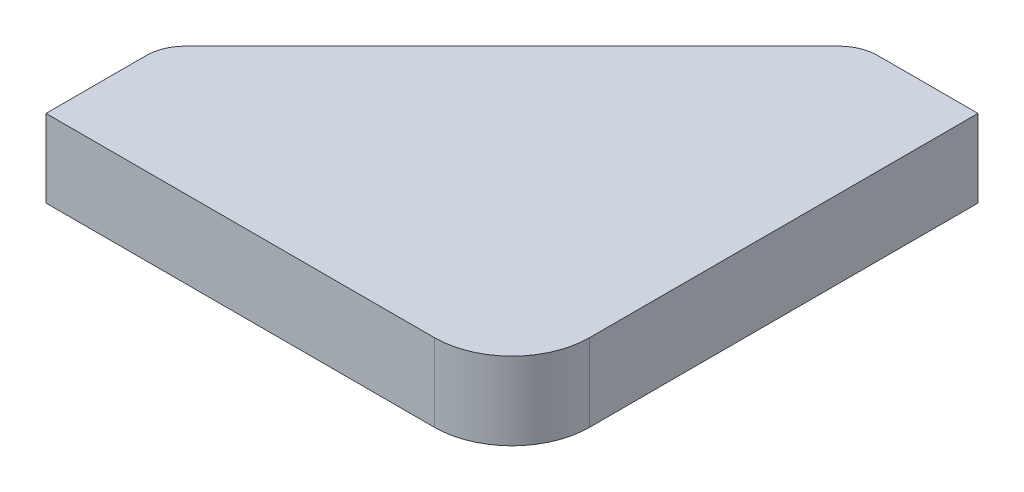
ISO-10303-21;
HEADER;
FILE_DESCRIPTION(('STEP AP214'),'2;1');
FILE_NAME('part.step','',(''),(''),'','','');
FILE_SCHEMA(('AUTOMOTIVE_DESIGN { 1 0 10303 214 1 1 1 1 }'));
ENDSEC;
DATA;
#1=APPLICATION_CONTEXT('core data for automotive mechanical design processes');
#2=APPLICATION_PROTOCOL_DEFINITION('international standard','automotive_design',2000,#1);
#3=PRODUCT_CONTEXT('',#1,'mechanical');
#4=PRODUCT('Part','Part','',(#3));
#5=PRODUCT_RELATED_PRODUCT_CATEGORY('part','',(#4));
#6=PRODUCT_DEFINITION_FORMATION('','',#4);
#7=PRODUCT_DEFINITION_CONTEXT('part definition',#1,'design');
#8=PRODUCT_DEFINITION('design','',#6,#7);
#9=PRODUCT_DEFINITION_SHAPE('','',#8);
#10=(LENGTH_UNIT() NAMED_UNIT(*) SI_UNIT(.MILLI.,.METRE.));
#11=(NAMED_UNIT(*) PLANE_ANGLE_UNIT() SI_UNIT($,.RADIAN.));
#12=(NAMED_UNIT(*) SI_UNIT($,.STERADIAN.) SOLID_ANGLE_UNIT());
#13=UNCERTAINTY_MEASURE_WITH_UNIT(LENGTH_MEASURE(1.E-05),#10,'distance_accuracy_value','');
#14=(GEOMETRIC_REPRESENTATION_CONTEXT(3) GLOBAL_UNCERTAINTY_ASSIGNED_CONTEXT((#13)) GLOBAL_UNIT_ASSIGNED_CONTEXT((#10,
#11,#12)) REPRESENTATION_CONTEXT('',''));
#15=CARTESIAN_POINT('',(0.,0.,0.));
#16=DIRECTION('',(0.,0.,1.));
#17=DIRECTION('',(1.,0.,0.));
#18=AXIS2_PLACEMENT_3D('',#15,#16,#17);
#19=CARTESIAN_POINT('',(-60.,-70.,-15.));
#20=DIRECTION('',(1.,0.,0.));
#21=DIRECTION('',(0.,0.,-1.));
#22=AXIS2_PLACEMENT_3D('',#19,#20,#21);
#23=PLANE('',#22);
#24=DIRECTION('',(0.,0.,-1.));
#25=VECTOR('',#24,1.);
#26=CARTESIAN_POINT('',(-60.,-60.,-15.));
#27=LINE('',#26,#25);
#28=CARTESIAN_POINT('',(-60.,-60.,0.));
#29=VERTEX_POINT('',#28);
#30=CARTESIAN_POINT('',(-60.,-60.,-12.9289321881345));
#31=VERTEX_POINT('',#30);
#32=EDGE_CURVE('E131',#29,#31,#27,.T.);
#33=ORIENTED_EDGE('',*,*,#32,.T.);
#34=DIRECTION('',(0.,1.,0.));
#35=VECTOR('',#34,1.);
#36=CARTESIAN_POINT('',(-60.,-70.,-12.9289321881345));
#37=LINE('',#36,#35);
#38=CARTESIAN_POINT('',(-60.,-70.,-12.9289321881345));
#39=VERTEX_POINT('',#38);
#40=EDGE_CURVE('E59',#31,#39,#37,.F.);
#41=ORIENTED_EDGE('',*,*,#40,.T.);
#42=DIRECTION('',(0.,0.,-1.));
#43=VECTOR('',#42,1.);
#44=CARTESIAN_POINT('',(-60.,-70.,-15.));
#45=LINE('',#44,#43);
#46=CARTESIAN_POINT('',(-60.,-70.,0.));
#47=VERTEX_POINT('',#46);
#48=EDGE_CURVE('E141',#47,#39,#45,.T.);
#49=ORIENTED_EDGE('',*,*,#48,.F.);
#50=DIRECTION('',(0.,1.,0.));
#51=VECTOR('',#50,1.);
#52=CARTESIAN_POINT('',(-60.,-70.,0.));
#53=LINE('',#52,#51);
#54=EDGE_CURVE('E121',#47,#29,#53,.T.);
#55=ORIENTED_EDGE('',*,*,#54,.T.);
#56=EDGE_LOOP('',(#33,#41,#49,#55));
#57=FACE_BOUND('',#56,.T.);
#58=ADVANCED_FACE('F36',(#57),#23,.F.);
#59=CARTESIAN_POINT('',(-15.,-70.,-60.));
#60=DIRECTION('',(0.707106781186547,0.,0.707106781186548));
#61=DIRECTION('',(0.707106781186548,0.,-0.707106781186547));
#62=AXIS2_PLACEMENT_3D('',#59,#60,#61);
#63=PLANE('',#62);
#64=DIRECTION('',(0.707106781186548,0.,-0.707106781186547));
#65=VECTOR('',#64,1.);
#66=CARTESIAN_POINT('',(-15.,-70.,-60.));
#67=LINE('',#66,#65);
#68=CARTESIAN_POINT('',(-58.5355339059328,-70.,-16.4644660940673));
#69=VERTEX_POINT('',#68);
#70=CARTESIAN_POINT('',(-16.4644660940673,-70.,-58.5355339059327));
#71=VERTEX_POINT('',#70);
#72=EDGE_CURVE('E110',#69,#71,#67,.T.);
#73=ORIENTED_EDGE('',*,*,#72,.F.);
#74=DIRECTION('',(0.,1.,0.));
#75=VECTOR('',#74,1.);
#76=CARTESIAN_POINT('',(-58.5355339059328,-70.,-16.4644660940673));
#77=LINE('',#76,#75);
#78=CARTESIAN_POINT('',(-58.5355339059328,-60.,-16.4644660940673));
#79=VERTEX_POINT('',#78);
#80=EDGE_CURVE('E153',#69,#79,#77,.T.);
#81=ORIENTED_EDGE('',*,*,#80,.T.);
#82=DIRECTION('',(0.707106781186548,0.,-0.707106781186547));
#83=VECTOR('',#82,1.);
#84=CARTESIAN_POINT('',(-15.,-60.,-60.));
#85=LINE('',#84,#83);
#86=CARTESIAN_POINT('',(-16.4644660940673,-60.,-58.5355339059327));
#87=VERTEX_POINT('',#86);
#88=EDGE_CURVE('E133',#79,#87,#85,.T.);
#89=ORIENTED_EDGE('',*,*,#88,.T.);
#90=DIRECTION('',(0.,1.,0.));
#91=VECTOR('',#90,1.);
#92=CARTESIAN_POINT('',(-16.4644660940673,-70.,-58.5355339059327));
#93=LINE('',#92,#91);
#94=EDGE_CURVE('E151',#87,#71,#93,.F.);
#95=ORIENTED_EDGE('',*,*,#94,.T.);
#96=EDGE_LOOP('',(#73,#81,#89,#95));
#97=FACE_BOUND('',#96,.T.);
#98=ADVANCED_FACE('F166',(#97),#63,.F.);
#99=CARTESIAN_POINT('',(0.,-70.,-60.));
#100=DIRECTION('',(0.,0.,1.));
#101=DIRECTION('',(1.,0.,0.));
#102=AXIS2_PLACEMENT_3D('',#99,#100,#101);
#103=PLANE('',#102);
#104=DIRECTION('',(1.,0.,0.));
#105=VECTOR('',#104,1.);
#106=CARTESIAN_POINT('',(0.,-70.,-60.));
#107=LINE('',#106,#105);
#108=CARTESIAN_POINT('',(-12.9289321881345,-70.,-60.));
#109=VERTEX_POINT('',#108);
#110=CARTESIAN_POINT('',(0.,-70.,-60.));
#111=VERTEX_POINT('',#110);
#112=EDGE_CURVE('E102',#109,#111,#107,.T.);
#113=ORIENTED_EDGE('',*,*,#112,.F.);
#114=DIRECTION('',(0.,1.,0.));
#115=VECTOR('',#114,1.);
#116=CARTESIAN_POINT('',(-12.9289321881345,-70.,-60.));
#117=LINE('',#116,#115);
#118=CARTESIAN_POINT('',(-12.9289321881345,-60.,-60.));
#119=VERTEX_POINT('',#118);
#120=EDGE_CURVE('E11',#109,#119,#117,.T.);
#121=ORIENTED_EDGE('',*,*,#120,.T.);
#122=DIRECTION('',(1.,0.,0.));
#123=VECTOR('',#122,1.);
#124=CARTESIAN_POINT('',(0.,-60.,-60.));
#125=LINE('',#124,#123);
#126=CARTESIAN_POINT('',(0.,-60.,-60.));
#127=VERTEX_POINT('',#126);
#128=EDGE_CURVE('E116',#119,#127,#125,.T.);
#129=ORIENTED_EDGE('',*,*,#128,.T.);
#130=DIRECTION('',(0.,1.,0.));
#131=VECTOR('',#130,1.);
#132=CARTESIAN_POINT('',(0.,-70.,-60.));
#133=LINE('',#132,#131);
#134=EDGE_CURVE('E113',#111,#127,#133,.T.);
#135=ORIENTED_EDGE('',*,*,#134,.F.);
#136=EDGE_LOOP('',(#113,#121,#129,#135));
#137=FACE_BOUND('',#136,.T.);
#138=ADVANCED_FACE('F114',(#137),#103,.F.);
#139=CARTESIAN_POINT('',(0.,-70.,0.));
#140=DIRECTION('',(-1.,0.,0.));
#141=DIRECTION('',(0.,0.,1.));
#142=AXIS2_PLACEMENT_3D('',#139,#140,#141);
#143=PLANE('',#142);
#144=DIRECTION('',(0.,0.,1.));
#145=VECTOR('',#144,1.);
#146=CARTESIAN_POINT('',(0.,-60.,0.));
#147=LINE('',#146,#145);
#148=CARTESIAN_POINT('',(0.,-60.,-10.));
#149=VERTEX_POINT('',#148);
#150=EDGE_CURVE('E137',#127,#149,#147,.T.);
#151=ORIENTED_EDGE('',*,*,#150,.T.);
#152=DIRECTION('',(0.,1.,0.));
#153=VECTOR('',#152,1.);
#154=CARTESIAN_POINT('',(0.,-70.,-10.));
#155=LINE('',#154,#153);
#156=CARTESIAN_POINT('',(0.,-70.,-10.));
#157=VERTEX_POINT('',#156);
#158=EDGE_CURVE('E125',#149,#157,#155,.F.);
#159=ORIENTED_EDGE('',*,*,#158,.T.);
#160=DIRECTION('',(0.,0.,1.));
#161=VECTOR('',#160,1.);
#162=CARTESIAN_POINT('',(0.,-70.,0.));
#163=LINE('',#162,#161);
#164=EDGE_CURVE('E106',#111,#157,#163,.T.);
#165=ORIENTED_EDGE('',*,*,#164,.F.);
#166=ORIENTED_EDGE('',*,*,#134,.T.);
#167=EDGE_LOOP('',(#151,#159,#165,#166));
#168=FACE_BOUND('',#167,.T.);
#169=ADVANCED_FACE('F123',(#168),#143,.F.);
#170=CARTESIAN_POINT('',(-60.,-70.,0.));
#171=DIRECTION('',(0.,0.,-1.));
#172=DIRECTION('',(0.,1.,0.));
#173=AXIS2_PLACEMENT_3D('',#170,#171,#172);
#174=PLANE('',#173);
#175=DIRECTION('',(-1.,0.,0.));
#176=VECTOR('',#175,1.);
#177=CARTESIAN_POINT('',(-60.,-70.,0.));
#178=LINE('',#177,#176);
#179=CARTESIAN_POINT('',(-10.,-70.,0.));
#180=VERTEX_POINT('',#179);
#181=EDGE_CURVE('E126',#180,#47,#178,.T.);
#182=ORIENTED_EDGE('',*,*,#181,.F.);
#183=DIRECTION('',(0.,1.,0.));
#184=VECTOR('',#183,1.);
#185=CARTESIAN_POINT('',(-10.,-70.,0.));
#186=LINE('',#185,#184);
#187=CARTESIAN_POINT('',(-10.,-60.,0.));
#188=VERTEX_POINT('',#187);
#189=EDGE_CURVE('E120',#180,#188,#186,.T.);
#190=ORIENTED_EDGE('',*,*,#189,.T.);
#191=DIRECTION('',(-1.,0.,0.));
#192=VECTOR('',#191,1.);
#193=CARTESIAN_POINT('',(-60.,-60.,0.));
#194=LINE('',#193,#192);
#195=EDGE_CURVE('E139',#188,#29,#194,.T.);
#196=ORIENTED_EDGE('',*,*,#195,.T.);
#197=ORIENTED_EDGE('',*,*,#54,.F.);
#198=EDGE_LOOP('',(#182,#190,#196,#197));
#199=FACE_BOUND('',#198,.T.);
#200=ADVANCED_FACE('F177',(#199),#174,.F.);
#201=CARTESIAN_POINT('',(0.,-70.,0.));
#202=DIRECTION('',(0.,1.,0.));
#203=DIRECTION('',(0.,0.,1.));
#204=AXIS2_PLACEMENT_3D('',#201,#202,#203);
#205=PLANE('',#204);
#206=ORIENTED_EDGE('',*,*,#48,.T.);
#207=CARTESIAN_POINT('',(-55.,-70.,-12.9289321881345));
#208=DIRECTION('',(0.,1.,0.));
#209=DIRECTION('',(0.,0.,1.));
#210=AXIS2_PLACEMENT_3D('',#207,#208,#209);
#211=CIRCLE('',#210,5.);
#212=EDGE_CURVE('E44',#39,#69,#211,.F.);
#213=ORIENTED_EDGE('',*,*,#212,.T.);
#214=ORIENTED_EDGE('',*,*,#72,.T.);
#215=CARTESIAN_POINT('',(-12.9289321881345,-70.,-55.));
#216=DIRECTION('',(0.,1.,0.));
#217=DIRECTION('',(0.,0.,1.));
#218=AXIS2_PLACEMENT_3D('',#215,#216,#217);
#219=CIRCLE('',#218,5.);
#220=EDGE_CURVE('E51',#71,#109,#219,.F.);
#221=ORIENTED_EDGE('',*,*,#220,.T.);
#222=ORIENTED_EDGE('',*,*,#112,.T.);
#223=ORIENTED_EDGE('',*,*,#164,.T.);
#224=CARTESIAN_POINT('',(-10.,-70.,-10.));
#225=DIRECTION('',(0.,1.,0.));
#226=DIRECTION('',(0.,0.,1.));
#227=AXIS2_PLACEMENT_3D('',#224,#225,#226);
#228=CIRCLE('',#227,10.);
#229=EDGE_CURVE('E149',#157,#180,#228,.F.);
#230=ORIENTED_EDGE('',*,*,#229,.T.);
#231=ORIENTED_EDGE('',*,*,#181,.T.);
#232=EDGE_LOOP('',(#206,#213,#214,#221,#222,#223,#230,#231));
#233=FACE_BOUND('',#232,.T.);
#234=ADVANCED_FACE('F104',(#233),#205,.F.);
#235=CARTESIAN_POINT('',(0.,-60.,0.));
#236=DIRECTION('',(0.,1.,0.));
#237=DIRECTION('',(0.,0.,1.));
#238=AXIS2_PLACEMENT_3D('',#235,#236,#237);
#239=PLANE('',#238);
#240=ORIENTED_EDGE('',*,*,#88,.F.);
#241=CARTESIAN_POINT('',(-55.,-60.,-12.9289321881345));
#242=DIRECTION('',(0.,1.,0.));
#243=DIRECTION('',(0.,0.,1.));
#244=AXIS2_PLACEMENT_3D('',#241,#242,#243);
#245=CIRCLE('',#244,5.);
#246=EDGE_CURVE('E158',#79,#31,#245,.T.);
#247=ORIENTED_EDGE('',*,*,#246,.T.);
#248=ORIENTED_EDGE('',*,*,#32,.F.);
#249=ORIENTED_EDGE('',*,*,#195,.F.);
#250=CARTESIAN_POINT('',(-10.,-60.,-10.));
#251=DIRECTION('',(0.,1.,0.));
#252=DIRECTION('',(0.,0.,1.));
#253=AXIS2_PLACEMENT_3D('',#250,#251,#252);
#254=CIRCLE('',#253,10.);
#255=EDGE_CURVE('E146',#188,#149,#254,.T.);
#256=ORIENTED_EDGE('',*,*,#255,.T.);
#257=ORIENTED_EDGE('',*,*,#150,.F.);
#258=ORIENTED_EDGE('',*,*,#128,.F.);
#259=CARTESIAN_POINT('',(-12.9289321881345,-60.,-55.));
#260=DIRECTION('',(0.,1.,0.));
#261=DIRECTION('',(0.,0.,1.));
#262=AXIS2_PLACEMENT_3D('',#259,#260,#261);
#263=CIRCLE('',#262,5.);
#264=EDGE_CURVE('E156',#119,#87,#263,.T.);
#265=ORIENTED_EDGE('',*,*,#264,.T.);
#266=EDGE_LOOP('',(#240,#247,#248,#249,#256,#257,#258,#265));
#267=FACE_BOUND('',#266,.T.);
#268=ADVANCED_FACE('F172',(#267),#239,.T.);
#269=CARTESIAN_POINT('',(-10.,-70.,-10.));
#270=DIRECTION('',(0.,1.,0.));
#271=DIRECTION('',(0.,0.,1.));
#272=AXIS2_PLACEMENT_3D('',#269,#270,#271);
#273=CYLINDRICAL_SURFACE('',#272,10.);
#274=ORIENTED_EDGE('',*,*,#229,.F.);
#275=ORIENTED_EDGE('',*,*,#158,.F.);
#276=ORIENTED_EDGE('',*,*,#255,.F.);
#277=ORIENTED_EDGE('',*,*,#189,.F.);
#278=EDGE_LOOP('',(#274,#275,#276,#277));
#279=FACE_BOUND('',#278,.T.);
#280=ADVANCED_FACE('F180',(#279),#273,.T.);
#281=CARTESIAN_POINT('',(-55.,-70.,-12.9289321881345));
#282=DIRECTION('',(0.,1.,0.));
#283=DIRECTION('',(0.,0.,1.));
#284=AXIS2_PLACEMENT_3D('',#281,#282,#283);
#285=CYLINDRICAL_SURFACE('',#284,5.);
#286=ORIENTED_EDGE('',*,*,#212,.F.);
#287=ORIENTED_EDGE('',*,*,#40,.F.);
#288=ORIENTED_EDGE('',*,*,#246,.F.);
#289=ORIENTED_EDGE('',*,*,#80,.F.);
#290=EDGE_LOOP('',(#286,#287,#288,#289));
#291=FACE_BOUND('',#290,.T.);
#292=ADVANCED_FACE('F169',(#291),#285,.T.);
#293=CARTESIAN_POINT('',(-12.9289321881345,-70.,-55.));
#294=DIRECTION('',(0.,1.,0.));
#295=DIRECTION('',(0.,0.,1.));
#296=AXIS2_PLACEMENT_3D('',#293,#294,#295);
#297=CYLINDRICAL_SURFACE('',#296,5.);
#298=ORIENTED_EDGE('',*,*,#220,.F.);
#299=ORIENTED_EDGE('',*,*,#94,.F.);
#300=ORIENTED_EDGE('',*,*,#264,.F.);
#301=ORIENTED_EDGE('',*,*,#120,.F.);
#302=EDGE_LOOP('',(#298,#299,#300,#301));
#303=FACE_BOUND('',#302,.T.);
#304=ADVANCED_FACE('F38',(#303),#297,.T.);
#305=CLOSED_SHELL('',(#58,#98,#138,#169,#200,#234,#268,#280,#292,#304));
#306=MANIFOLD_SOLID_BREP('B2',#305);
#307=ADVANCED_BREP_SHAPE_REPRESENTATION('',(#18,#306),#14);
#308=SHAPE_DEFINITION_REPRESENTATION(#9,#307);
ENDSEC;
END-ISO-10303-21;
